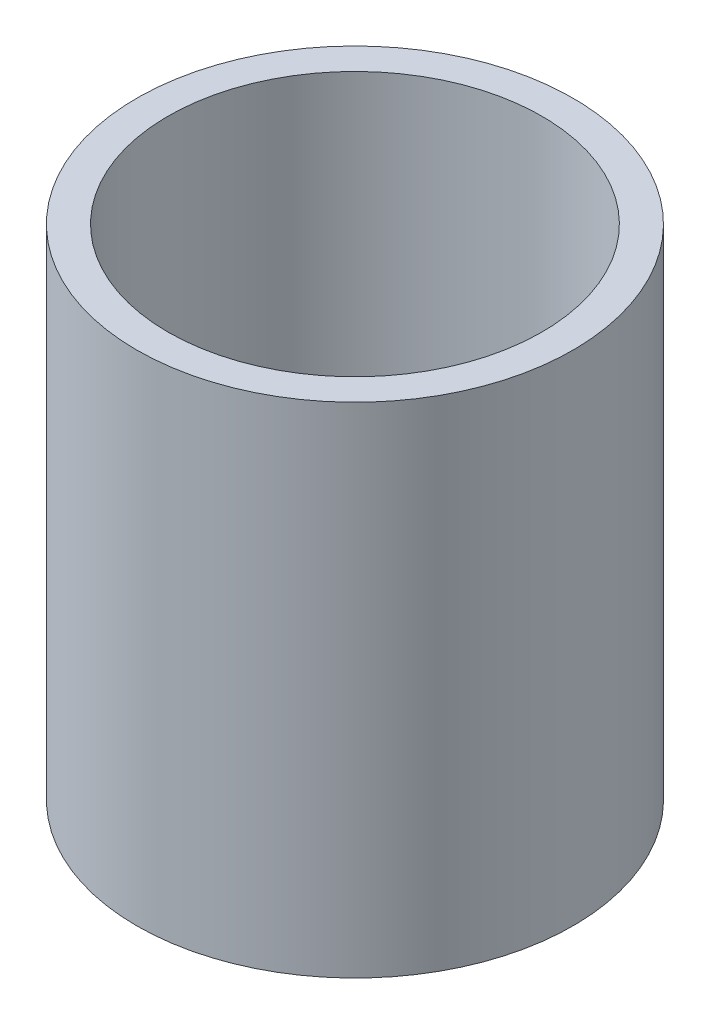
ISO-10303-21;
HEADER;
FILE_DESCRIPTION(('STEP AP214'),'2;1');
FILE_NAME('part.step','',(''),(''),'','','');
FILE_SCHEMA(('AUTOMOTIVE_DESIGN { 1 0 10303 214 1 1 1 1 }'));
ENDSEC;
DATA;
#1=APPLICATION_CONTEXT('core data for automotive mechanical design processes');
#2=APPLICATION_PROTOCOL_DEFINITION('international standard','automotive_design',2000,#1);
#3=PRODUCT_CONTEXT('',#1,'mechanical');
#4=PRODUCT('Part','Part','',(#3));
#5=PRODUCT_RELATED_PRODUCT_CATEGORY('part','',(#4));
#6=PRODUCT_DEFINITION_FORMATION('','',#4);
#7=PRODUCT_DEFINITION_CONTEXT('part definition',#1,'design');
#8=PRODUCT_DEFINITION('design','',#6,#7);
#9=PRODUCT_DEFINITION_SHAPE('','',#8);
#10=(LENGTH_UNIT() NAMED_UNIT(*) SI_UNIT(.MILLI.,.METRE.));
#11=(NAMED_UNIT(*) PLANE_ANGLE_UNIT() SI_UNIT($,.RADIAN.));
#12=(NAMED_UNIT(*) SI_UNIT($,.STERADIAN.) SOLID_ANGLE_UNIT());
#13=UNCERTAINTY_MEASURE_WITH_UNIT(LENGTH_MEASURE(1.E-05),#10,'distance_accuracy_value','');
#14=(GEOMETRIC_REPRESENTATION_CONTEXT(3) GLOBAL_UNCERTAINTY_ASSIGNED_CONTEXT((#13)) GLOBAL_UNIT_ASSIGNED_CONTEXT((#10,
#11,#12)) REPRESENTATION_CONTEXT('',''));
#15=CARTESIAN_POINT('',(0.,0.,0.));
#16=DIRECTION('',(0.,0.,1.));
#17=DIRECTION('',(1.,0.,0.));
#18=AXIS2_PLACEMENT_3D('',#15,#16,#17);
#19=CARTESIAN_POINT('',(0.,8.,0.));
#20=DIRECTION('',(0.,1.,0.));
#21=DIRECTION('',(0.,0.,1.));
#22=AXIS2_PLACEMENT_3D('',#19,#20,#21);
#23=PLANE('',#22);
#24=CARTESIAN_POINT('',(0.,8.,0.));
#25=DIRECTION('',(0.,1.,0.));
#26=DIRECTION('',(0.,0.,1.));
#27=AXIS2_PLACEMENT_3D('',#24,#25,#26);
#28=CIRCLE('',#27,3.5);
#29=CARTESIAN_POINT('',(0.,8.,3.5));
#30=VERTEX_POINT('',#29);
#31=EDGE_CURVE('E10',#30,#30,#28,.T.);
#32=ORIENTED_EDGE('',*,*,#31,.T.);
#33=EDGE_LOOP('',(#32));
#34=FACE_BOUND('',#33,.T.);
#35=CARTESIAN_POINT('',(0.,8.,0.));
#36=DIRECTION('',(0.,1.,0.));
#37=DIRECTION('',(0.,0.,1.));
#38=AXIS2_PLACEMENT_3D('',#35,#36,#37);
#39=CIRCLE('',#38,3.);
#40=CARTESIAN_POINT('',(0.,8.,3.));
#41=VERTEX_POINT('',#40);
#42=EDGE_CURVE('E42',#41,#41,#39,.T.);
#43=ORIENTED_EDGE('',*,*,#42,.F.);
#44=EDGE_LOOP('',(#43));
#45=FACE_BOUND('',#44,.T.);
#46=ADVANCED_FACE('F31',(#34,#45),#23,.T.);
#47=CARTESIAN_POINT('',(0.,0.,0.));
#48=DIRECTION('',(0.,1.,0.));
#49=DIRECTION('',(0.,0.,1.));
#50=AXIS2_PLACEMENT_3D('',#47,#48,#49);
#51=PLANE('',#50);
#52=CARTESIAN_POINT('',(0.,0.,0.));
#53=DIRECTION('',(0.,1.,0.));
#54=DIRECTION('',(0.,0.,1.));
#55=AXIS2_PLACEMENT_3D('',#52,#53,#54);
#56=CIRCLE('',#55,3.5);
#57=CARTESIAN_POINT('',(0.,0.,3.5));
#58=VERTEX_POINT('',#57);
#59=EDGE_CURVE('E35',#58,#58,#56,.T.);
#60=ORIENTED_EDGE('',*,*,#59,.F.);
#61=EDGE_LOOP('',(#60));
#62=FACE_BOUND('',#61,.T.);
#63=CARTESIAN_POINT('',(0.,0.,0.));
#64=DIRECTION('',(0.,1.,0.));
#65=DIRECTION('',(0.,0.,1.));
#66=AXIS2_PLACEMENT_3D('',#63,#64,#65);
#67=CIRCLE('',#66,3.);
#68=CARTESIAN_POINT('',(0.,0.,3.));
#69=VERTEX_POINT('',#68);
#70=EDGE_CURVE('E44',#69,#69,#67,.T.);
#71=ORIENTED_EDGE('',*,*,#70,.T.);
#72=EDGE_LOOP('',(#71));
#73=FACE_BOUND('',#72,.T.);
#74=ADVANCED_FACE('F54',(#62,#73),#51,.F.);
#75=CARTESIAN_POINT('',(0.,8.,0.));
#76=DIRECTION('',(0.,-1.,0.));
#77=DIRECTION('',(0.,0.,-1.));
#78=AXIS2_PLACEMENT_3D('',#75,#76,#77);
#79=CYLINDRICAL_SURFACE('',#78,3.5);
#80=ORIENTED_EDGE('',*,*,#31,.F.);
#81=EDGE_LOOP('',(#80));
#82=FACE_BOUND('',#81,.T.);
#83=ORIENTED_EDGE('',*,*,#59,.T.);
#84=EDGE_LOOP('',(#83));
#85=FACE_BOUND('',#84,.T.);
#86=ADVANCED_FACE('F33',(#82,#85),#79,.T.);
#87=CARTESIAN_POINT('',(0.,8.,0.));
#88=DIRECTION('',(0.,-1.,0.));
#89=DIRECTION('',(0.,0.,-1.));
#90=AXIS2_PLACEMENT_3D('',#87,#88,#89);
#91=CYLINDRICAL_SURFACE('',#90,3.);
#92=ORIENTED_EDGE('',*,*,#42,.T.);
#93=EDGE_LOOP('',(#92));
#94=FACE_BOUND('',#93,.T.);
#95=ORIENTED_EDGE('',*,*,#70,.F.);
#96=EDGE_LOOP('',(#95));
#97=FACE_BOUND('',#96,.T.);
#98=ADVANCED_FACE('F50',(#94,#97),#91,.F.);
#99=CLOSED_SHELL('',(#46,#74,#86,#98));
#100=MANIFOLD_SOLID_BREP('B2',#99);
#101=ADVANCED_BREP_SHAPE_REPRESENTATION('',(#18,#100),#14);
#102=SHAPE_DEFINITION_REPRESENTATION(#9,#101);
ENDSEC;
END-ISO-10303-21;
